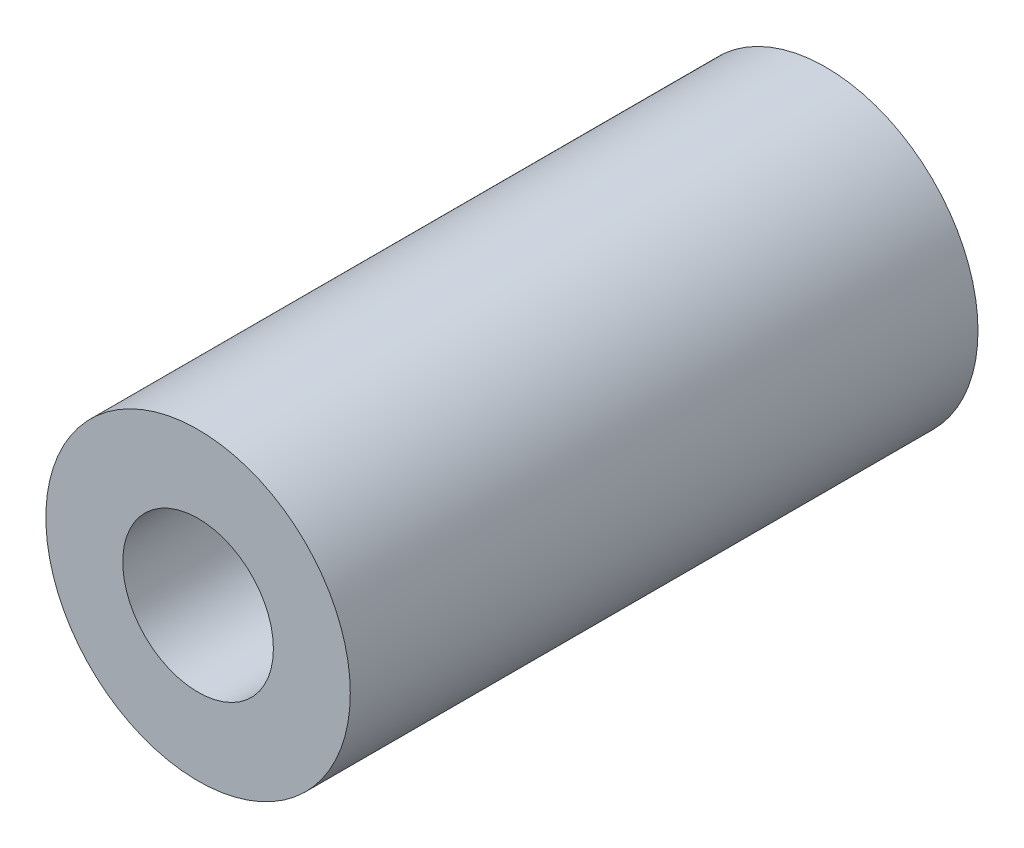
ISO-10303-21;
HEADER;
FILE_DESCRIPTION(('STEP AP214'),'2;1');
FILE_NAME('part.step','',(''),(''),'','','');
FILE_SCHEMA(('AUTOMOTIVE_DESIGN { 1 0 10303 214 1 1 1 1 }'));
ENDSEC;
DATA;
#1=APPLICATION_CONTEXT('core data for automotive mechanical design processes');
#2=APPLICATION_PROTOCOL_DEFINITION('international standard','automotive_design',2000,#1);
#3=PRODUCT_CONTEXT('',#1,'mechanical');
#4=PRODUCT('Part','Part','',(#3));
#5=PRODUCT_RELATED_PRODUCT_CATEGORY('part','',(#4));
#6=PRODUCT_DEFINITION_FORMATION('','',#4);
#7=PRODUCT_DEFINITION_CONTEXT('part definition',#1,'design');
#8=PRODUCT_DEFINITION('design','',#6,#7);
#9=PRODUCT_DEFINITION_SHAPE('','',#8);
#10=(LENGTH_UNIT() NAMED_UNIT(*) SI_UNIT(.MILLI.,.METRE.));
#11=(NAMED_UNIT(*) PLANE_ANGLE_UNIT() SI_UNIT($,.RADIAN.));
#12=(NAMED_UNIT(*) SI_UNIT($,.STERADIAN.) SOLID_ANGLE_UNIT());
#13=UNCERTAINTY_MEASURE_WITH_UNIT(LENGTH_MEASURE(1.E-05),#10,'distance_accuracy_value','');
#14=(GEOMETRIC_REPRESENTATION_CONTEXT(3) GLOBAL_UNCERTAINTY_ASSIGNED_CONTEXT((#13)) GLOBAL_UNIT_ASSIGNED_CONTEXT((#10,
#11,#12)) REPRESENTATION_CONTEXT('',''));
#15=CARTESIAN_POINT('',(0.,0.,0.));
#16=DIRECTION('',(0.,0.,1.));
#17=DIRECTION('',(1.,0.,0.));
#18=AXIS2_PLACEMENT_3D('',#15,#16,#17);
#19=CARTESIAN_POINT('',(0.,0.,20.));
#20=DIRECTION('',(0.,0.,1.));
#21=DIRECTION('',(1.,0.,0.));
#22=AXIS2_PLACEMENT_3D('',#19,#20,#21);
#23=PLANE('',#22);
#24=CARTESIAN_POINT('',(0.,0.,20.));
#25=DIRECTION('',(0.,0.,1.));
#26=DIRECTION('',(1.,0.,0.));
#27=AXIS2_PLACEMENT_3D('',#24,#25,#26);
#28=CIRCLE('',#27,4.85);
#29=CARTESIAN_POINT('',(4.85,0.,20.));
#30=VERTEX_POINT('',#29);
#31=EDGE_CURVE('E10',#30,#30,#28,.T.);
#32=ORIENTED_EDGE('',*,*,#31,.T.);
#33=EDGE_LOOP('',(#32));
#34=FACE_BOUND('',#33,.T.);
#35=CARTESIAN_POINT('',(0.,0.,20.));
#36=DIRECTION('',(0.,0.,1.));
#37=DIRECTION('',(1.,0.,0.));
#38=AXIS2_PLACEMENT_3D('',#35,#36,#37);
#39=CIRCLE('',#38,2.4);
#40=CARTESIAN_POINT('',(2.4,0.,20.));
#41=VERTEX_POINT('',#40);
#42=EDGE_CURVE('E48',#41,#41,#39,.T.);
#43=ORIENTED_EDGE('',*,*,#42,.F.);
#44=EDGE_LOOP('',(#43));
#45=FACE_BOUND('',#44,.T.);
#46=ADVANCED_FACE('F37',(#34,#45),#23,.T.);
#47=CARTESIAN_POINT('',(0.,0.,0.));
#48=DIRECTION('',(0.,0.,1.));
#49=DIRECTION('',(1.,0.,0.));
#50=AXIS2_PLACEMENT_3D('',#47,#48,#49);
#51=PLANE('',#50);
#52=CARTESIAN_POINT('',(0.,0.,0.));
#53=DIRECTION('',(0.,0.,1.));
#54=DIRECTION('',(1.,0.,0.));
#55=AXIS2_PLACEMENT_3D('',#52,#53,#54);
#56=CIRCLE('',#55,4.85);
#57=CARTESIAN_POINT('',(4.85,0.,0.));
#58=VERTEX_POINT('',#57);
#59=EDGE_CURVE('E41',#58,#58,#56,.T.);
#60=ORIENTED_EDGE('',*,*,#59,.F.);
#61=EDGE_LOOP('',(#60));
#62=FACE_BOUND('',#61,.T.);
#63=CARTESIAN_POINT('',(0.,0.,0.));
#64=DIRECTION('',(0.,0.,1.));
#65=DIRECTION('',(1.,0.,0.));
#66=AXIS2_PLACEMENT_3D('',#63,#64,#65);
#67=CIRCLE('',#66,2.4);
#68=CARTESIAN_POINT('',(2.4,0.,0.));
#69=VERTEX_POINT('',#68);
#70=EDGE_CURVE('E50',#69,#69,#67,.T.);
#71=ORIENTED_EDGE('',*,*,#70,.T.);
#72=EDGE_LOOP('',(#71));
#73=FACE_BOUND('',#72,.T.);
#74=ADVANCED_FACE('F60',(#62,#73),#51,.F.);
#75=CARTESIAN_POINT('',(0.,0.,20.));
#76=DIRECTION('',(0.,0.,-1.));
#77=DIRECTION('',(-1.,0.,0.));
#78=AXIS2_PLACEMENT_3D('',#75,#76,#77);
#79=CYLINDRICAL_SURFACE('',#78,4.85);
#80=ORIENTED_EDGE('',*,*,#31,.F.);
#81=EDGE_LOOP('',(#80));
#82=FACE_BOUND('',#81,.T.);
#83=ORIENTED_EDGE('',*,*,#59,.T.);
#84=EDGE_LOOP('',(#83));
#85=FACE_BOUND('',#84,.T.);
#86=ADVANCED_FACE('F39',(#82,#85),#79,.T.);
#87=CARTESIAN_POINT('',(0.,0.,20.));
#88=DIRECTION('',(0.,0.,-1.));
#89=DIRECTION('',(-1.,0.,0.));
#90=AXIS2_PLACEMENT_3D('',#87,#88,#89);
#91=CYLINDRICAL_SURFACE('',#90,2.4);
#92=ORIENTED_EDGE('',*,*,#42,.T.);
#93=EDGE_LOOP('',(#92));
#94=FACE_BOUND('',#93,.T.);
#95=ORIENTED_EDGE('',*,*,#70,.F.);
#96=EDGE_LOOP('',(#95));
#97=FACE_BOUND('',#96,.T.);
#98=ADVANCED_FACE('F56',(#94,#97),#91,.F.);
#99=CLOSED_SHELL('',(#46,#74,#86,#98));
#100=MANIFOLD_SOLID_BREP('B2',#99);
#101=ADVANCED_BREP_SHAPE_REPRESENTATION('',(#18,#100),#14);
#102=SHAPE_DEFINITION_REPRESENTATION(#9,#101);
ENDSEC;
END-ISO-10303-21;
